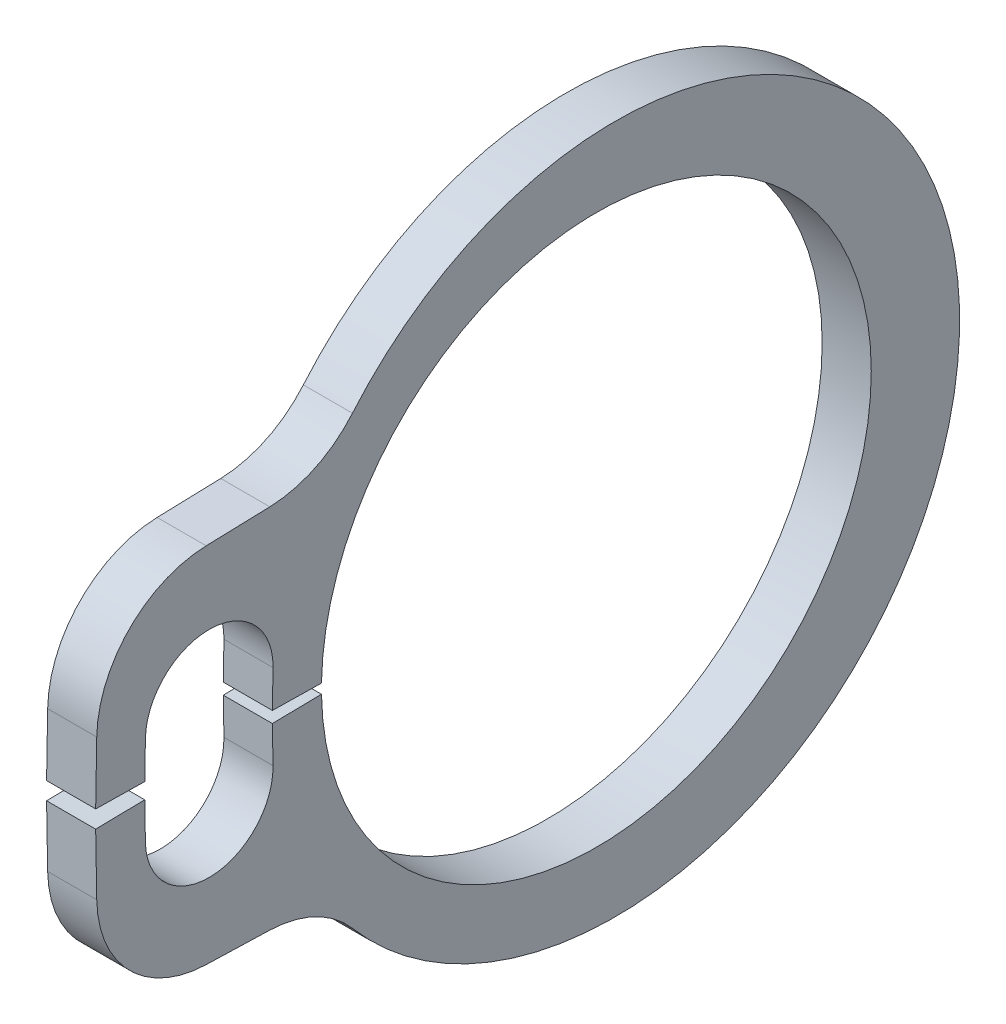
ISO-10303-21;
HEADER;
FILE_DESCRIPTION(('STEP AP214'),'2;1');
FILE_NAME('part.step','',(''),(''),'','','');
FILE_SCHEMA(('AUTOMOTIVE_DESIGN { 1 0 10303 214 1 1 1 1 }'));
ENDSEC;
DATA;
#1=APPLICATION_CONTEXT('core data for automotive mechanical design processes');
#2=APPLICATION_PROTOCOL_DEFINITION('international standard','automotive_design',2000,#1);
#3=PRODUCT_CONTEXT('',#1,'mechanical');
#4=PRODUCT('Part','Part','',(#3));
#5=PRODUCT_RELATED_PRODUCT_CATEGORY('part','',(#4));
#6=PRODUCT_DEFINITION_FORMATION('','',#4);
#7=PRODUCT_DEFINITION_CONTEXT('part definition',#1,'design');
#8=PRODUCT_DEFINITION('design','',#6,#7);
#9=PRODUCT_DEFINITION_SHAPE('','',#8);
#10=(LENGTH_UNIT() NAMED_UNIT(*) SI_UNIT(.MILLI.,.METRE.));
#11=(NAMED_UNIT(*) PLANE_ANGLE_UNIT() SI_UNIT($,.RADIAN.));
#12=(NAMED_UNIT(*) SI_UNIT($,.STERADIAN.) SOLID_ANGLE_UNIT());
#13=UNCERTAINTY_MEASURE_WITH_UNIT(LENGTH_MEASURE(1.E-05),#10,'distance_accuracy_value','');
#14=(GEOMETRIC_REPRESENTATION_CONTEXT(3) GLOBAL_UNCERTAINTY_ASSIGNED_CONTEXT((#13)) GLOBAL_UNIT_ASSIGNED_CONTEXT((#10,
#11,#12)) REPRESENTATION_CONTEXT('',''));
#15=CARTESIAN_POINT('',(0.,0.,0.));
#16=DIRECTION('',(0.,0.,1.));
#17=DIRECTION('',(1.,0.,0.));
#18=AXIS2_PLACEMENT_3D('',#15,#16,#17);
#19=CARTESIAN_POINT('',(0.127,0.,0.));
#20=DIRECTION('',(-1.,0.,0.));
#21=DIRECTION('',(0.,-1.,0.));
#22=AXIS2_PLACEMENT_3D('',#19,#20,#21);
#23=CYLINDRICAL_SURFACE('',#22,1.4224);
#24=CARTESIAN_POINT('',(-0.127,0.,0.));
#25=DIRECTION('',(-1.,0.,0.));
#26=DIRECTION('',(0.,1.,0.));
#27=AXIS2_PLACEMENT_3D('',#24,#25,#26);
#28=CIRCLE('',#27,1.4224);
#29=CARTESIAN_POINT('',(-0.127,0.0248243029163921,1.42218336159045));
#30=VERTEX_POINT('',#29);
#31=CARTESIAN_POINT('',(-0.127,-0.0248243029163921,1.42218336159045));
#32=VERTEX_POINT('',#31);
#33=EDGE_CURVE('E232',#30,#32,#28,.T.);
#34=ORIENTED_EDGE('',*,*,#33,.T.);
#35=DIRECTION('',(-1.,0.,0.));
#36=VECTOR('',#35,1.);
#37=CARTESIAN_POINT('',(0.127,-0.0248243029163921,1.42218336159045));
#38=LINE('',#37,#36);
#39=CARTESIAN_POINT('',(0.127,-0.0248243029163921,1.42218336159045));
#40=VERTEX_POINT('',#39);
#41=EDGE_CURVE('E212',#40,#32,#38,.T.);
#42=ORIENTED_EDGE('',*,*,#41,.F.);
#43=CARTESIAN_POINT('',(0.127,0.,0.));
#44=DIRECTION('',(-1.,0.,0.));
#45=DIRECTION('',(0.,1.,0.));
#46=AXIS2_PLACEMENT_3D('',#43,#44,#45);
#47=CIRCLE('',#46,1.4224);
#48=CARTESIAN_POINT('',(0.127,0.0248243029163921,1.42218336159045));
#49=VERTEX_POINT('',#48);
#50=EDGE_CURVE('E219',#49,#40,#47,.T.);
#51=ORIENTED_EDGE('',*,*,#50,.F.);
#52=DIRECTION('',(-1.,0.,0.));
#53=VECTOR('',#52,1.);
#54=CARTESIAN_POINT('',(0.127,0.0248243029163921,1.42218336159045));
#55=LINE('',#54,#53);
#56=EDGE_CURVE('E339',#49,#30,#55,.T.);
#57=ORIENTED_EDGE('',*,*,#56,.T.);
#58=EDGE_LOOP('',(#34,#42,#51,#57));
#59=FACE_BOUND('',#58,.T.);
#60=ADVANCED_FACE('F17',(#59),#23,.F.);
#61=CARTESIAN_POINT('',(0.127,-0.0292572141514622,1.67614467616018));
#62=DIRECTION('',(0.,-0.999847695156391,-0.0174524064372837));
#63=DIRECTION('',(0.,0.0174524064372837,-0.999847695156391));
#64=AXIS2_PLACEMENT_3D('',#61,#62,#63);
#65=PLANE('',#64);
#66=DIRECTION('',(0.,-0.0174524064372837,0.999847695156391));
#67=VECTOR('',#66,1.);
#68=CARTESIAN_POINT('',(-0.127,-0.0292572141514622,1.67614467616018));
#69=LINE('',#68,#67);
#70=CARTESIAN_POINT('',(-0.127,-0.0292572141514622,1.67614467616018));
#71=VERTEX_POINT('',#70);
#72=EDGE_CURVE('E342',#32,#71,#69,.T.);
#73=ORIENTED_EDGE('',*,*,#72,.T.);
#74=DIRECTION('',(-1.,0.,0.));
#75=VECTOR('',#74,1.);
#76=CARTESIAN_POINT('',(0.127,-0.0292572141514622,1.67614467616018));
#77=LINE('',#76,#75);
#78=CARTESIAN_POINT('',(0.127,-0.0292572141514622,1.67614467616018));
#79=VERTEX_POINT('',#78);
#80=EDGE_CURVE('E215',#79,#71,#77,.T.);
#81=ORIENTED_EDGE('',*,*,#80,.F.);
#82=DIRECTION('',(0.,-0.0174524064372837,0.999847695156391));
#83=VECTOR('',#82,1.);
#84=CARTESIAN_POINT('',(0.127,-0.0292572141514622,1.67614467616018));
#85=LINE('',#84,#83);
#86=EDGE_CURVE('E208',#40,#79,#85,.T.);
#87=ORIENTED_EDGE('',*,*,#86,.F.);
#88=ORIENTED_EDGE('',*,*,#41,.T.);
#89=EDGE_LOOP('',(#73,#81,#87,#88));
#90=FACE_BOUND('',#89,.T.);
#91=ADVANCED_FACE('F210',(#90),#65,.F.);
#92=CARTESIAN_POINT('',(0.127,-0.0292572141514622,1.67614467616018));
#93=DIRECTION('',(0.,0.0174524064372829,-0.999847695156391));
#94=DIRECTION('',(0.,0.999847695156391,0.0174524064372829));
#95=AXIS2_PLACEMENT_3D('',#92,#93,#94);
#96=PLANE('',#95);
#97=DIRECTION('',(0.,-0.999847695156391,-0.0174524064372829));
#98=VECTOR('',#97,1.);
#99=CARTESIAN_POINT('',(-0.127,-0.0292572141514622,1.67614467616018));
#100=LINE('',#99,#98);
#101=CARTESIAN_POINT('',(-0.127,-0.219728200078755,1.67281999273387));
#102=VERTEX_POINT('',#101);
#103=EDGE_CURVE('E345',#71,#102,#100,.T.);
#104=ORIENTED_EDGE('',*,*,#103,.T.);
#105=DIRECTION('',(-1.,0.,0.));
#106=VECTOR('',#105,1.);
#107=CARTESIAN_POINT('',(0.127,-0.219728200078755,1.67281999273387));
#108=LINE('',#107,#106);
#109=CARTESIAN_POINT('',(0.127,-0.219728200078755,1.67281999273387));
#110=VERTEX_POINT('',#109);
#111=EDGE_CURVE('E243',#110,#102,#108,.T.);
#112=ORIENTED_EDGE('',*,*,#111,.F.);
#113=DIRECTION('',(0.,-0.999847695156391,-0.0174524064372829));
#114=VECTOR('',#113,1.);
#115=CARTESIAN_POINT('',(0.127,-0.0292572141514622,1.67614467616018));
#116=LINE('',#115,#114);
#117=EDGE_CURVE('E218',#79,#110,#116,.T.);
#118=ORIENTED_EDGE('',*,*,#117,.F.);
#119=ORIENTED_EDGE('',*,*,#80,.T.);
#120=EDGE_LOOP('',(#104,#112,#118,#119));
#121=FACE_BOUND('',#120,.T.);
#122=ADVANCED_FACE('F481',(#121),#96,.F.);
#123=CARTESIAN_POINT('',(0.127,-0.225490984684346,2.00296970167451));
#124=DIRECTION('',(-1.,0.,0.));
#125=DIRECTION('',(0.,-1.,0.));
#126=AXIS2_PLACEMENT_3D('',#123,#124,#125);
#127=CYLINDRICAL_SURFACE('',#126,0.3302);
#128=CARTESIAN_POINT('',(-0.127,-0.225490984684346,2.00296970167451));
#129=DIRECTION('',(-1.,0.,0.));
#130=DIRECTION('',(0.,-1.,0.));
#131=AXIS2_PLACEMENT_3D('',#128,#129,#130);
#132=CIRCLE('',#131,0.3302);
#133=CARTESIAN_POINT('',(-0.127,-0.231253769289937,2.33311941061516));
#134=VERTEX_POINT('',#133);
#135=EDGE_CURVE('E348',#102,#134,#132,.T.);
#136=ORIENTED_EDGE('',*,*,#135,.T.);
#137=DIRECTION('',(-1.,0.,0.));
#138=VECTOR('',#137,1.);
#139=CARTESIAN_POINT('',(0.127,-0.231253769289937,2.33311941061516));
#140=LINE('',#139,#138);
#141=CARTESIAN_POINT('',(0.127,-0.231253769289937,2.33311941061516));
#142=VERTEX_POINT('',#141);
#143=EDGE_CURVE('E412',#142,#134,#140,.T.);
#144=ORIENTED_EDGE('',*,*,#143,.F.);
#145=CARTESIAN_POINT('',(0.127,-0.225490984684346,2.00296970167451));
#146=DIRECTION('',(-1.,0.,0.));
#147=DIRECTION('',(0.,-1.,0.));
#148=AXIS2_PLACEMENT_3D('',#145,#146,#147);
#149=CIRCLE('',#148,0.3302);
#150=EDGE_CURVE('E425',#110,#142,#149,.T.);
#151=ORIENTED_EDGE('',*,*,#150,.F.);
#152=ORIENTED_EDGE('',*,*,#111,.T.);
#153=EDGE_LOOP('',(#136,#144,#151,#152));
#154=FACE_BOUND('',#153,.T.);
#155=ADVANCED_FACE('F423',(#154),#127,.F.);
#156=CARTESIAN_POINT('',(0.127,-0.0407827833626442,2.33644409404146));
#157=DIRECTION('',(0.,-0.0174524064372829,0.999847695156391));
#158=DIRECTION('',(0.,-0.999847695156391,-0.0174524064372829));
#159=AXIS2_PLACEMENT_3D('',#156,#157,#158);
#160=PLANE('',#159);
#161=DIRECTION('',(0.,0.999847695156391,0.0174524064372829));
#162=VECTOR('',#161,1.);
#163=CARTESIAN_POINT('',(-0.127,-0.0407827833626442,2.33644409404146));
#164=LINE('',#163,#162);
#165=CARTESIAN_POINT('',(-0.127,-0.0407827833626442,2.33644409404146));
#166=VERTEX_POINT('',#165);
#167=EDGE_CURVE('E351',#134,#166,#164,.T.);
#168=ORIENTED_EDGE('',*,*,#167,.T.);
#169=DIRECTION('',(-1.,0.,0.));
#170=VECTOR('',#169,1.);
#171=CARTESIAN_POINT('',(0.127,-0.0407827833626442,2.33644409404146));
#172=LINE('',#171,#170);
#173=CARTESIAN_POINT('',(0.127,-0.0407827833626442,2.33644409404146));
#174=VERTEX_POINT('',#173);
#175=EDGE_CURVE('E408',#174,#166,#172,.T.);
#176=ORIENTED_EDGE('',*,*,#175,.F.);
#177=DIRECTION('',(0.,0.999847695156391,0.0174524064372829));
#178=VECTOR('',#177,1.);
#179=CARTESIAN_POINT('',(0.127,-0.0407827833626442,2.33644409404146));
#180=LINE('',#179,#178);
#181=EDGE_CURVE('E442',#142,#174,#180,.T.);
#182=ORIENTED_EDGE('',*,*,#181,.F.);
#183=ORIENTED_EDGE('',*,*,#143,.T.);
#184=EDGE_LOOP('',(#168,#176,#182,#183));
#185=FACE_BOUND('',#184,.T.);
#186=ADVANCED_FACE('F433',(#185),#160,.F.);
#187=CARTESIAN_POINT('',(0.127,-0.0407827833626442,2.33644409404146));
#188=DIRECTION('',(0.,-0.999847695156391,-0.0174524064372833));
#189=DIRECTION('',(0.,0.0174524064372833,-0.999847695156391));
#190=AXIS2_PLACEMENT_3D('',#187,#188,#189);
#191=PLANE('',#190);
#192=DIRECTION('',(0.,-0.0174524064372833,0.999847695156391));
#193=VECTOR('',#192,1.);
#194=CARTESIAN_POINT('',(-0.127,-0.0407827833626442,2.33644409404146));
#195=LINE('',#194,#193);
#196=CARTESIAN_POINT('',(-0.127,-0.0452156945977142,2.59040540861118));
#197=VERTEX_POINT('',#196);
#198=EDGE_CURVE('E354',#166,#197,#195,.T.);
#199=ORIENTED_EDGE('',*,*,#198,.T.);
#200=DIRECTION('',(-1.,0.,0.));
#201=VECTOR('',#200,1.);
#202=CARTESIAN_POINT('',(0.127,-0.0452156945977142,2.59040540861118));
#203=LINE('',#202,#201);
#204=CARTESIAN_POINT('',(0.127,-0.0452156945977142,2.59040540861118));
#205=VERTEX_POINT('',#204);
#206=EDGE_CURVE('E404',#205,#197,#203,.T.);
#207=ORIENTED_EDGE('',*,*,#206,.F.);
#208=DIRECTION('',(0.,-0.0174524064372833,0.999847695156391));
#209=VECTOR('',#208,1.);
#210=CARTESIAN_POINT('',(0.127,-0.0407827833626442,2.33644409404146));
#211=LINE('',#210,#209);
#212=EDGE_CURVE('E439',#174,#205,#211,.T.);
#213=ORIENTED_EDGE('',*,*,#212,.F.);
#214=ORIENTED_EDGE('',*,*,#175,.T.);
#215=EDGE_LOOP('',(#199,#207,#213,#214));
#216=FACE_BOUND('',#215,.T.);
#217=ADVANCED_FACE('F437',(#216),#191,.F.);
#218=CARTESIAN_POINT('',(0.127,-0.0452156945977142,2.59040540861118));
#219=DIRECTION('',(0.,0.0174524064372835,-0.999847695156391));
#220=DIRECTION('',(0.,0.999847695156391,0.0174524064372835));
#221=AXIS2_PLACEMENT_3D('',#218,#219,#220);
#222=PLANE('',#221);
#223=DIRECTION('',(0.,-0.999847695156391,-0.0174524064372835));
#224=VECTOR('',#223,1.);
#225=CARTESIAN_POINT('',(-0.127,-0.0452156945977142,2.59040540861118));
#226=LINE('',#225,#224);
#227=CARTESIAN_POINT('',(-0.127,-0.364602379655856,2.58483049328628));
#228=VERTEX_POINT('',#227);
#229=EDGE_CURVE('E357',#197,#228,#226,.T.);
#230=ORIENTED_EDGE('',*,*,#229,.T.);
#231=DIRECTION('',(-1.,0.,0.));
#232=VECTOR('',#231,1.);
#233=CARTESIAN_POINT('',(0.127,-0.364602379655856,2.58483049328628));
#234=LINE('',#233,#232);
#235=CARTESIAN_POINT('',(0.127,-0.364602379655856,2.58483049328628));
#236=VERTEX_POINT('',#235);
#237=EDGE_CURVE('E51',#228,#236,#234,.F.);
#238=ORIENTED_EDGE('',*,*,#237,.T.);
#239=DIRECTION('',(0.,-0.999847695156391,-0.0174524064372835));
#240=VECTOR('',#239,1.);
#241=CARTESIAN_POINT('',(0.127,-0.0452156945977142,2.59040540861118));
#242=LINE('',#241,#240);
#243=EDGE_CURVE('E441',#205,#236,#242,.T.);
#244=ORIENTED_EDGE('',*,*,#243,.F.);
#245=ORIENTED_EDGE('',*,*,#206,.T.);
#246=EDGE_LOOP('',(#230,#238,#244,#245));
#247=FACE_BOUND('',#246,.T.);
#248=ADVANCED_FACE('F466',(#247),#222,.F.);
#249=CARTESIAN_POINT('',(0.127,-0.92138222986326,2.57511186485019));
#250=DIRECTION('',(0.,0.999536448867091,-0.0304448252772845));
#251=DIRECTION('',(0.,0.0304448252772845,0.999536448867091));
#252=AXIS2_PLACEMENT_3D('',#249,#250,#251);
#253=PLANE('',#252);
#254=DIRECTION('',(0.,-0.0304448252772845,-0.999536448867091));
#255=VECTOR('',#254,1.);
#256=CARTESIAN_POINT('',(-0.127,-0.92138222986326,2.57511186485019));
#257=LINE('',#256,#255);
#258=CARTESIAN_POINT('',(-0.127,-0.93833587724335,2.0185053367029));
#259=VERTEX_POINT('',#258);
#260=CARTESIAN_POINT('',(-0.127,-0.948361312054998,1.68935949931621));
#261=VERTEX_POINT('',#260);
#262=EDGE_CURVE('E305',#259,#261,#257,.T.);
#263=ORIENTED_EDGE('',*,*,#262,.T.);
#264=DIRECTION('',(1.,0.,0.));
#265=VECTOR('',#264,1.);
#266=CARTESIAN_POINT('',(0.127,-0.948361312054998,1.68935949931621));
#267=LINE('',#266,#265);
#268=CARTESIAN_POINT('',(0.127,-0.948361312054998,1.68935949931621));
#269=VERTEX_POINT('',#268);
#270=EDGE_CURVE('E254',#261,#269,#267,.T.);
#271=ORIENTED_EDGE('',*,*,#270,.T.);
#272=DIRECTION('',(0.,-0.0304448252772845,-0.999536448867091));
#273=VECTOR('',#272,1.);
#274=CARTESIAN_POINT('',(0.127,-0.92138222986326,2.57511186485019));
#275=LINE('',#274,#273);
#276=CARTESIAN_POINT('',(0.127,-0.93833587724335,2.0185053367029));
#277=VERTEX_POINT('',#276);
#278=EDGE_CURVE('E323',#277,#269,#275,.T.);
#279=ORIENTED_EDGE('',*,*,#278,.F.);
#280=DIRECTION('',(-1.,0.,0.));
#281=VECTOR('',#280,1.);
#282=CARTESIAN_POINT('',(0.127,-0.93833587724335,2.0185053367029));
#283=LINE('',#282,#281);
#284=EDGE_CURVE('E250',#277,#259,#283,.T.);
#285=ORIENTED_EDGE('',*,*,#284,.T.);
#286=EDGE_LOOP('',(#263,#271,#279,#285));
#287=FACE_BOUND('',#286,.T.);
#288=ADVANCED_FACE('F463',(#287),#253,.F.);
#289=CARTESIAN_POINT('',(0.127,0.,-0.0968666422557803));
#290=DIRECTION('',(-1.,0.,0.));
#291=DIRECTION('',(0.,-1.,0.));
#292=AXIS2_PLACEMENT_3D('',#289,#290,#291);
#293=CYLINDRICAL_SURFACE('',#292,1.78273335774422);
#294=CARTESIAN_POINT('',(0.127,0.,-0.0968666422557803));
#295=DIRECTION('',(1.,0.,0.));
#296=DIRECTION('',(0.,1.,0.));
#297=AXIS2_PLACEMENT_3D('',#294,#295,#296);
#298=CIRCLE('',#297,1.78273335774422);
#299=CARTESIAN_POINT('',(0.127,-1.1540947652548,1.26188406984171));
#300=VERTEX_POINT('',#299);
#301=CARTESIAN_POINT('',(0.127,1.1540947652548,1.26188406984171));
#302=VERTEX_POINT('',#301);
#303=EDGE_CURVE('E311',#300,#302,#298,.T.);
#304=ORIENTED_EDGE('',*,*,#303,.F.);
#305=DIRECTION('',(-1.,0.,0.));
#306=VECTOR('',#305,1.);
#307=CARTESIAN_POINT('',(0.127,-1.1540947652548,1.26188406984171));
#308=LINE('',#307,#306);
#309=CARTESIAN_POINT('',(-0.127,-1.1540947652548,1.26188406984171));
#310=VERTEX_POINT('',#309);
#311=EDGE_CURVE('E241',#300,#310,#308,.T.);
#312=ORIENTED_EDGE('',*,*,#311,.T.);
#313=CARTESIAN_POINT('',(-0.127,0.,-0.0968666422557803));
#314=DIRECTION('',(1.,0.,0.));
#315=DIRECTION('',(0.,1.,0.));
#316=AXIS2_PLACEMENT_3D('',#313,#314,#315);
#317=CIRCLE('',#316,1.78273335774422);
#318=CARTESIAN_POINT('',(-0.127,1.1540947652548,1.26188406984171));
#319=VERTEX_POINT('',#318);
#320=EDGE_CURVE('E293',#310,#319,#317,.T.);
#321=ORIENTED_EDGE('',*,*,#320,.T.);
#322=DIRECTION('',(-1.,0.,0.));
#323=VECTOR('',#322,1.);
#324=CARTESIAN_POINT('',(0.127,1.1540947652548,1.26188406984171));
#325=LINE('',#324,#323);
#326=EDGE_CURVE('E234',#319,#302,#325,.F.);
#327=ORIENTED_EDGE('',*,*,#326,.T.);
#328=EDGE_LOOP('',(#304,#312,#321,#327));
#329=FACE_BOUND('',#328,.T.);
#330=ADVANCED_FACE('F301',(#329),#293,.T.);
#331=CARTESIAN_POINT('',(0.127,0.92138222986326,2.57511186485019));
#332=DIRECTION('',(0.,-0.999536448867091,-0.0304448252772845));
#333=DIRECTION('',(0.,0.0304448252772845,-0.999536448867091));
#334=AXIS2_PLACEMENT_3D('',#331,#332,#333);
#335=PLANE('',#334);
#336=DIRECTION('',(0.,-0.0304448252772845,0.999536448867091));
#337=VECTOR('',#336,1.);
#338=CARTESIAN_POINT('',(0.127,0.92138222986326,2.57511186485019));
#339=LINE('',#338,#337);
#340=CARTESIAN_POINT('',(0.127,0.948361312054998,1.68935949931621));
#341=VERTEX_POINT('',#340);
#342=CARTESIAN_POINT('',(0.127,0.93833587724335,2.0185053367029));
#343=VERTEX_POINT('',#342);
#344=EDGE_CURVE('E310',#341,#343,#339,.T.);
#345=ORIENTED_EDGE('',*,*,#344,.F.);
#346=DIRECTION('',(1.,0.,0.));
#347=VECTOR('',#346,1.);
#348=CARTESIAN_POINT('',(-0.127,0.948361312054998,1.68935949931621));
#349=LINE('',#348,#347);
#350=CARTESIAN_POINT('',(-0.127,0.948361312054998,1.68935949931621));
#351=VERTEX_POINT('',#350);
#352=EDGE_CURVE('E260',#341,#351,#349,.F.);
#353=ORIENTED_EDGE('',*,*,#352,.T.);
#354=DIRECTION('',(0.,-0.0304448252772845,0.999536448867091));
#355=VECTOR('',#354,1.);
#356=CARTESIAN_POINT('',(-0.127,0.92138222986326,2.57511186485019));
#357=LINE('',#356,#355);
#358=CARTESIAN_POINT('',(-0.127,0.93833587724335,2.0185053367029));
#359=VERTEX_POINT('',#358);
#360=EDGE_CURVE('E295',#351,#359,#357,.T.);
#361=ORIENTED_EDGE('',*,*,#360,.T.);
#362=DIRECTION('',(-1.,0.,0.));
#363=VECTOR('',#362,1.);
#364=CARTESIAN_POINT('',(0.127,0.93833587724335,2.0185053367029));
#365=LINE('',#364,#363);
#366=EDGE_CURVE('E257',#359,#343,#365,.F.);
#367=ORIENTED_EDGE('',*,*,#366,.T.);
#368=EDGE_LOOP('',(#345,#353,#361,#367));
#369=FACE_BOUND('',#368,.T.);
#370=ADVANCED_FACE('F313',(#369),#335,.F.);
#371=CARTESIAN_POINT('',(0.127,0.0452156945977142,2.59040540861118));
#372=DIRECTION('',(0.,-0.0174524064372835,-0.999847695156391));
#373=DIRECTION('',(0.,0.999847695156391,-0.0174524064372835));
#374=AXIS2_PLACEMENT_3D('',#371,#372,#373);
#375=PLANE('',#374);
#376=DIRECTION('',(0.,-0.999847695156391,0.0174524064372835));
#377=VECTOR('',#376,1.);
#378=CARTESIAN_POINT('',(0.127,0.0452156945977142,2.59040540861118));
#379=LINE('',#378,#377);
#380=CARTESIAN_POINT('',(0.127,0.364602379655856,2.58483049328628));
#381=VERTEX_POINT('',#380);
#382=CARTESIAN_POINT('',(0.127,0.0452156945977142,2.59040540861118));
#383=VERTEX_POINT('',#382);
#384=EDGE_CURVE('E316',#381,#383,#379,.T.);
#385=ORIENTED_EDGE('',*,*,#384,.F.);
#386=DIRECTION('',(-1.,0.,0.));
#387=VECTOR('',#386,1.);
#388=CARTESIAN_POINT('',(0.127,0.364602379655856,2.58483049328628));
#389=LINE('',#388,#387);
#390=CARTESIAN_POINT('',(-0.127,0.364602379655856,2.58483049328628));
#391=VERTEX_POINT('',#390);
#392=EDGE_CURVE('E275',#381,#391,#389,.T.);
#393=ORIENTED_EDGE('',*,*,#392,.T.);
#394=DIRECTION('',(0.,-0.999847695156391,0.0174524064372835));
#395=VECTOR('',#394,1.);
#396=CARTESIAN_POINT('',(-0.127,0.0452156945977142,2.59040540861118));
#397=LINE('',#396,#395);
#398=CARTESIAN_POINT('',(-0.127,0.0452156945977142,2.59040540861118));
#399=VERTEX_POINT('',#398);
#400=EDGE_CURVE('E365',#391,#399,#397,.T.);
#401=ORIENTED_EDGE('',*,*,#400,.T.);
#402=DIRECTION('',(-1.,0.,0.));
#403=VECTOR('',#402,1.);
#404=CARTESIAN_POINT('',(0.127,0.0452156945977142,2.59040540861118));
#405=LINE('',#404,#403);
#406=EDGE_CURVE('E400',#383,#399,#405,.T.);
#407=ORIENTED_EDGE('',*,*,#406,.F.);
#408=EDGE_LOOP('',(#385,#393,#401,#407));
#409=FACE_BOUND('',#408,.T.);
#410=ADVANCED_FACE('F498',(#409),#375,.F.);
#411=CARTESIAN_POINT('',(0.127,0.0407827833626442,2.33644409404146));
#412=DIRECTION('',(0.,0.999847695156391,-0.0174524064372833));
#413=DIRECTION('',(0.,0.0174524064372833,0.999847695156391));
#414=AXIS2_PLACEMENT_3D('',#411,#412,#413);
#415=PLANE('',#414);
#416=DIRECTION('',(0.,-0.0174524064372833,-0.999847695156391));
#417=VECTOR('',#416,1.);
#418=CARTESIAN_POINT('',(-0.127,0.0407827833626442,2.33644409404146));
#419=LINE('',#418,#417);
#420=CARTESIAN_POINT('',(-0.127,0.0407827833626442,2.33644409404146));
#421=VERTEX_POINT('',#420);
#422=EDGE_CURVE('E368',#399,#421,#419,.T.);
#423=ORIENTED_EDGE('',*,*,#422,.T.);
#424=DIRECTION('',(-1.,0.,0.));
#425=VECTOR('',#424,1.);
#426=CARTESIAN_POINT('',(0.127,0.0407827833626442,2.33644409404146));
#427=LINE('',#426,#425);
#428=CARTESIAN_POINT('',(0.127,0.0407827833626442,2.33644409404146));
#429=VERTEX_POINT('',#428);
#430=EDGE_CURVE('E396',#429,#421,#427,.T.);
#431=ORIENTED_EDGE('',*,*,#430,.F.);
#432=DIRECTION('',(0.,-0.0174524064372833,-0.999847695156391));
#433=VECTOR('',#432,1.);
#434=CARTESIAN_POINT('',(0.127,0.0407827833626442,2.33644409404146));
#435=LINE('',#434,#433);
#436=EDGE_CURVE('E320',#383,#429,#435,.T.);
#437=ORIENTED_EDGE('',*,*,#436,.F.);
#438=ORIENTED_EDGE('',*,*,#406,.T.);
#439=EDGE_LOOP('',(#423,#431,#437,#438));
#440=FACE_BOUND('',#439,.T.);
#441=ADVANCED_FACE('F505',(#440),#415,.F.);
#442=CARTESIAN_POINT('',(0.127,0.0407827833626442,2.33644409404146));
#443=DIRECTION('',(0.,0.0174524064372829,0.999847695156391));
#444=DIRECTION('',(0.,-0.999847695156391,0.0174524064372829));
#445=AXIS2_PLACEMENT_3D('',#442,#443,#444);
#446=PLANE('',#445);
#447=DIRECTION('',(0.,0.999847695156391,-0.0174524064372829));
#448=VECTOR('',#447,1.);
#449=CARTESIAN_POINT('',(-0.127,0.0407827833626442,2.33644409404146));
#450=LINE('',#449,#448);
#451=CARTESIAN_POINT('',(-0.127,0.231253769289937,2.33311941061516));
#452=VERTEX_POINT('',#451);
#453=EDGE_CURVE('E371',#421,#452,#450,.T.);
#454=ORIENTED_EDGE('',*,*,#453,.T.);
#455=DIRECTION('',(-1.,0.,0.));
#456=VECTOR('',#455,1.);
#457=CARTESIAN_POINT('',(0.127,0.231253769289937,2.33311941061516));
#458=LINE('',#457,#456);
#459=CARTESIAN_POINT('',(0.127,0.231253769289937,2.33311941061516));
#460=VERTEX_POINT('',#459);
#461=EDGE_CURVE('E392',#460,#452,#458,.T.);
#462=ORIENTED_EDGE('',*,*,#461,.F.);
#463=DIRECTION('',(0.,0.999847695156391,-0.0174524064372829));
#464=VECTOR('',#463,1.);
#465=CARTESIAN_POINT('',(0.127,0.0407827833626442,2.33644409404146));
#466=LINE('',#465,#464);
#467=EDGE_CURVE('E329',#429,#460,#466,.T.);
#468=ORIENTED_EDGE('',*,*,#467,.F.);
#469=ORIENTED_EDGE('',*,*,#430,.T.);
#470=EDGE_LOOP('',(#454,#462,#468,#469));
#471=FACE_BOUND('',#470,.T.);
#472=ADVANCED_FACE('F509',(#471),#446,.F.);
#473=CARTESIAN_POINT('',(0.127,0.225490984684346,2.00296970167451));
#474=DIRECTION('',(-1.,0.,0.));
#475=DIRECTION('',(0.,-1.,0.));
#476=AXIS2_PLACEMENT_3D('',#473,#474,#475);
#477=CYLINDRICAL_SURFACE('',#476,0.3302);
#478=CARTESIAN_POINT('',(-0.127,0.225490984684346,2.00296970167451));
#479=DIRECTION('',(-1.,0.,0.));
#480=DIRECTION('',(0.,1.,0.));
#481=AXIS2_PLACEMENT_3D('',#478,#479,#480);
#482=CIRCLE('',#481,0.3302);
#483=CARTESIAN_POINT('',(-0.127,0.219728200078755,1.67281999273387));
#484=VERTEX_POINT('',#483);
#485=EDGE_CURVE('E374',#452,#484,#482,.T.);
#486=ORIENTED_EDGE('',*,*,#485,.T.);
#487=DIRECTION('',(-1.,0.,0.));
#488=VECTOR('',#487,1.);
#489=CARTESIAN_POINT('',(0.127,0.219728200078755,1.67281999273387));
#490=LINE('',#489,#488);
#491=CARTESIAN_POINT('',(0.127,0.219728200078755,1.67281999273387));
#492=VERTEX_POINT('',#491);
#493=EDGE_CURVE('E388',#492,#484,#490,.T.);
#494=ORIENTED_EDGE('',*,*,#493,.F.);
#495=CARTESIAN_POINT('',(0.127,0.225490984684346,2.00296970167451));
#496=DIRECTION('',(-1.,0.,0.));
#497=DIRECTION('',(0.,1.,0.));
#498=AXIS2_PLACEMENT_3D('',#495,#496,#497);
#499=CIRCLE('',#498,0.3302);
#500=EDGE_CURVE('E332',#460,#492,#499,.T.);
#501=ORIENTED_EDGE('',*,*,#500,.F.);
#502=ORIENTED_EDGE('',*,*,#461,.T.);
#503=EDGE_LOOP('',(#486,#494,#501,#502));
#504=FACE_BOUND('',#503,.T.);
#505=ADVANCED_FACE('F516',(#504),#477,.F.);
#506=CARTESIAN_POINT('',(0.127,0.0292572141514622,1.67614467616018));
#507=DIRECTION('',(0.,-0.0174524064372829,-0.999847695156391));
#508=DIRECTION('',(0.,0.999847695156391,-0.0174524064372829));
#509=AXIS2_PLACEMENT_3D('',#506,#507,#508);
#510=PLANE('',#509);
#511=DIRECTION('',(0.,-0.999847695156391,0.0174524064372829));
#512=VECTOR('',#511,1.);
#513=CARTESIAN_POINT('',(-0.127,0.0292572141514622,1.67614467616018));
#514=LINE('',#513,#512);
#515=CARTESIAN_POINT('',(-0.127,0.0292572141514622,1.67614467616018));
#516=VERTEX_POINT('',#515);
#517=EDGE_CURVE('E377',#484,#516,#514,.T.);
#518=ORIENTED_EDGE('',*,*,#517,.T.);
#519=DIRECTION('',(-1.,0.,0.));
#520=VECTOR('',#519,1.);
#521=CARTESIAN_POINT('',(0.127,0.0292572141514622,1.67614467616018));
#522=LINE('',#521,#520);
#523=CARTESIAN_POINT('',(0.127,0.0292572141514622,1.67614467616018));
#524=VERTEX_POINT('',#523);
#525=EDGE_CURVE('E384',#524,#516,#522,.T.);
#526=ORIENTED_EDGE('',*,*,#525,.F.);
#527=DIRECTION('',(0.,-0.999847695156391,0.0174524064372829));
#528=VECTOR('',#527,1.);
#529=CARTESIAN_POINT('',(0.127,0.0292572141514622,1.67614467616018));
#530=LINE('',#529,#528);
#531=EDGE_CURVE('E335',#492,#524,#530,.T.);
#532=ORIENTED_EDGE('',*,*,#531,.F.);
#533=ORIENTED_EDGE('',*,*,#493,.T.);
#534=EDGE_LOOP('',(#518,#526,#532,#533));
#535=FACE_BOUND('',#534,.T.);
#536=ADVANCED_FACE('F519',(#535),#510,.F.);
#537=CARTESIAN_POINT('',(0.127,0.0292572141514622,1.67614467616018));
#538=DIRECTION('',(0.,0.999847695156391,-0.0174524064372837));
#539=DIRECTION('',(0.,0.0174524064372837,0.999847695156391));
#540=AXIS2_PLACEMENT_3D('',#537,#538,#539);
#541=PLANE('',#540);
#542=DIRECTION('',(0.,-0.0174524064372837,-0.999847695156391));
#543=VECTOR('',#542,1.);
#544=CARTESIAN_POINT('',(-0.127,0.0292572141514622,1.67614467616018));
#545=LINE('',#544,#543);
#546=EDGE_CURVE('E229',#516,#30,#545,.T.);
#547=ORIENTED_EDGE('',*,*,#546,.T.);
#548=ORIENTED_EDGE('',*,*,#56,.F.);
#549=DIRECTION('',(0.,-0.0174524064372837,-0.999847695156391));
#550=VECTOR('',#549,1.);
#551=CARTESIAN_POINT('',(0.127,0.0292572141514622,1.67614467616018));
#552=LINE('',#551,#550);
#553=EDGE_CURVE('E224',#524,#49,#552,.T.);
#554=ORIENTED_EDGE('',*,*,#553,.F.);
#555=ORIENTED_EDGE('',*,*,#525,.T.);
#556=EDGE_LOOP('',(#547,#548,#554,#555));
#557=FACE_BOUND('',#556,.T.);
#558=ADVANCED_FACE('F522',(#557),#541,.F.);
#559=CARTESIAN_POINT('',(0.127,0.,0.));
#560=DIRECTION('',(1.,0.,0.));
#561=DIRECTION('',(0.,1.,0.));
#562=AXIS2_PLACEMENT_3D('',#559,#560,#561);
#563=PLANE('',#562);
#564=ORIENTED_EDGE('',*,*,#243,.T.);
#565=CARTESIAN_POINT('',(0.127,-0.354406683815195,2.00071946977592));
#566=DIRECTION('',(1.,0.,0.));
#567=DIRECTION('',(0.,1.,0.));
#568=AXIS2_PLACEMENT_3D('',#565,#566,#567);
#569=CIRCLE('',#568,0.5842);
#570=EDGE_CURVE('E272',#236,#277,#569,.T.);
#571=ORIENTED_EDGE('',*,*,#570,.T.);
#572=ORIENTED_EDGE('',*,*,#278,.T.);
#573=CARTESIAN_POINT('',(0.127,-1.53229050548316,1.7071453662432));
#574=DIRECTION('',(1.,0.,0.));
#575=DIRECTION('',(0.,1.,0.));
#576=AXIS2_PLACEMENT_3D('',#573,#574,#575);
#577=CIRCLE('',#576,0.5842);
#578=EDGE_CURVE('E282',#269,#300,#577,.F.);
#579=ORIENTED_EDGE('',*,*,#578,.T.);
#580=ORIENTED_EDGE('',*,*,#303,.T.);
#581=CARTESIAN_POINT('',(0.127,1.53229050548316,1.7071453662432));
#582=DIRECTION('',(1.,0.,0.));
#583=DIRECTION('',(0.,1.,0.));
#584=AXIS2_PLACEMENT_3D('',#581,#582,#583);
#585=CIRCLE('',#584,0.5842);
#586=EDGE_CURVE('E11',#302,#341,#585,.F.);
#587=ORIENTED_EDGE('',*,*,#586,.T.);
#588=ORIENTED_EDGE('',*,*,#344,.T.);
#589=CARTESIAN_POINT('',(0.127,0.354406683815195,2.00071946977592));
#590=DIRECTION('',(1.,0.,0.));
#591=DIRECTION('',(0.,1.,0.));
#592=AXIS2_PLACEMENT_3D('',#589,#590,#591);
#593=CIRCLE('',#592,0.5842);
#594=EDGE_CURVE('E39',#343,#381,#593,.T.);
#595=ORIENTED_EDGE('',*,*,#594,.T.);
#596=ORIENTED_EDGE('',*,*,#384,.T.);
#597=ORIENTED_EDGE('',*,*,#436,.T.);
#598=ORIENTED_EDGE('',*,*,#467,.T.);
#599=ORIENTED_EDGE('',*,*,#500,.T.);
#600=ORIENTED_EDGE('',*,*,#531,.T.);
#601=ORIENTED_EDGE('',*,*,#553,.T.);
#602=ORIENTED_EDGE('',*,*,#50,.T.);
#603=ORIENTED_EDGE('',*,*,#86,.T.);
#604=ORIENTED_EDGE('',*,*,#117,.T.);
#605=ORIENTED_EDGE('',*,*,#150,.T.);
#606=ORIENTED_EDGE('',*,*,#181,.T.);
#607=ORIENTED_EDGE('',*,*,#212,.T.);
#608=EDGE_LOOP('',(#564,#571,#572,#579,#580,#587,#588,#595,#596,#597,#598,#599,#600,#601,#602,
#603,#604,#605,#606,#607));
#609=FACE_BOUND('',#608,.T.);
#610=ADVANCED_FACE('F222',(#609),#563,.T.);
#611=CARTESIAN_POINT('',(-0.127,0.,0.));
#612=DIRECTION('',(1.,0.,0.));
#613=DIRECTION('',(0.,1.,0.));
#614=AXIS2_PLACEMENT_3D('',#611,#612,#613);
#615=PLANE('',#614);
#616=ORIENTED_EDGE('',*,*,#262,.F.);
#617=CARTESIAN_POINT('',(-0.127,-0.354406683815195,2.00071946977592));
#618=DIRECTION('',(1.,0.,0.));
#619=DIRECTION('',(0.,1.,0.));
#620=AXIS2_PLACEMENT_3D('',#617,#618,#619);
#621=CIRCLE('',#620,0.5842);
#622=EDGE_CURVE('E267',#259,#228,#621,.F.);
#623=ORIENTED_EDGE('',*,*,#622,.T.);
#624=ORIENTED_EDGE('',*,*,#229,.F.);
#625=ORIENTED_EDGE('',*,*,#198,.F.);
#626=ORIENTED_EDGE('',*,*,#167,.F.);
#627=ORIENTED_EDGE('',*,*,#135,.F.);
#628=ORIENTED_EDGE('',*,*,#103,.F.);
#629=ORIENTED_EDGE('',*,*,#72,.F.);
#630=ORIENTED_EDGE('',*,*,#33,.F.);
#631=ORIENTED_EDGE('',*,*,#546,.F.);
#632=ORIENTED_EDGE('',*,*,#517,.F.);
#633=ORIENTED_EDGE('',*,*,#485,.F.);
#634=ORIENTED_EDGE('',*,*,#453,.F.);
#635=ORIENTED_EDGE('',*,*,#422,.F.);
#636=ORIENTED_EDGE('',*,*,#400,.F.);
#637=CARTESIAN_POINT('',(-0.127,0.354406683815195,2.00071946977592));
#638=DIRECTION('',(1.,0.,0.));
#639=DIRECTION('',(0.,1.,0.));
#640=AXIS2_PLACEMENT_3D('',#637,#638,#639);
#641=CIRCLE('',#640,0.5842);
#642=EDGE_CURVE('E264',#391,#359,#641,.F.);
#643=ORIENTED_EDGE('',*,*,#642,.T.);
#644=ORIENTED_EDGE('',*,*,#360,.F.);
#645=CARTESIAN_POINT('',(-0.127,1.53229050548316,1.7071453662432));
#646=DIRECTION('',(1.,0.,0.));
#647=DIRECTION('',(0.,1.,0.));
#648=AXIS2_PLACEMENT_3D('',#645,#646,#647);
#649=CIRCLE('',#648,0.5842);
#650=EDGE_CURVE('E26',#351,#319,#649,.T.);
#651=ORIENTED_EDGE('',*,*,#650,.T.);
#652=ORIENTED_EDGE('',*,*,#320,.F.);
#653=CARTESIAN_POINT('',(-0.127,-1.53229050548316,1.7071453662432));
#654=DIRECTION('',(1.,0.,0.));
#655=DIRECTION('',(0.,1.,0.));
#656=AXIS2_PLACEMENT_3D('',#653,#654,#655);
#657=CIRCLE('',#656,0.5842);
#658=EDGE_CURVE('E279',#310,#261,#657,.T.);
#659=ORIENTED_EDGE('',*,*,#658,.T.);
#660=EDGE_LOOP('',(#616,#623,#624,#625,#626,#627,#628,#629,#630,#631,#632,#633,#634,#635,#636,
#643,#644,#651,#652,#659));
#661=FACE_BOUND('',#660,.T.);
#662=ADVANCED_FACE('F292',(#661),#615,.F.);
#663=CARTESIAN_POINT('',(0.127,-1.53229050548316,1.7071453662432));
#664=DIRECTION('',(-1.,0.,0.));
#665=DIRECTION('',(0.,-1.,0.));
#666=AXIS2_PLACEMENT_3D('',#663,#664,#665);
#667=CYLINDRICAL_SURFACE('',#666,0.5842);
#668=ORIENTED_EDGE('',*,*,#578,.F.);
#669=ORIENTED_EDGE('',*,*,#270,.F.);
#670=ORIENTED_EDGE('',*,*,#658,.F.);
#671=ORIENTED_EDGE('',*,*,#311,.F.);
#672=EDGE_LOOP('',(#668,#669,#670,#671));
#673=FACE_BOUND('',#672,.T.);
#674=ADVANCED_FACE('F462',(#673),#667,.F.);
#675=CARTESIAN_POINT('',(0.127,1.53229050548316,1.7071453662432));
#676=DIRECTION('',(-1.,0.,0.));
#677=DIRECTION('',(0.,-1.,0.));
#678=AXIS2_PLACEMENT_3D('',#675,#676,#677);
#679=CYLINDRICAL_SURFACE('',#678,0.5842);
#680=ORIENTED_EDGE('',*,*,#586,.F.);
#681=ORIENTED_EDGE('',*,*,#326,.F.);
#682=ORIENTED_EDGE('',*,*,#650,.F.);
#683=ORIENTED_EDGE('',*,*,#352,.F.);
#684=EDGE_LOOP('',(#680,#681,#682,#683));
#685=FACE_BOUND('',#684,.T.);
#686=ADVANCED_FACE('F308',(#685),#679,.F.);
#687=CARTESIAN_POINT('',(0.127,-0.354406683815195,2.00071946977592));
#688=DIRECTION('',(-1.,0.,0.));
#689=DIRECTION('',(0.,-1.,0.));
#690=AXIS2_PLACEMENT_3D('',#687,#688,#689);
#691=CYLINDRICAL_SURFACE('',#690,0.5842);
#692=ORIENTED_EDGE('',*,*,#570,.F.);
#693=ORIENTED_EDGE('',*,*,#237,.F.);
#694=ORIENTED_EDGE('',*,*,#622,.F.);
#695=ORIENTED_EDGE('',*,*,#284,.F.);
#696=EDGE_LOOP('',(#692,#693,#694,#695));
#697=FACE_BOUND('',#696,.T.);
#698=ADVANCED_FACE('F465',(#697),#691,.T.);
#699=CARTESIAN_POINT('',(0.127,0.354406683815195,2.00071946977592));
#700=DIRECTION('',(-1.,0.,0.));
#701=DIRECTION('',(0.,-1.,0.));
#702=AXIS2_PLACEMENT_3D('',#699,#700,#701);
#703=CYLINDRICAL_SURFACE('',#702,0.5842);
#704=ORIENTED_EDGE('',*,*,#594,.F.);
#705=ORIENTED_EDGE('',*,*,#366,.F.);
#706=ORIENTED_EDGE('',*,*,#642,.F.);
#707=ORIENTED_EDGE('',*,*,#392,.F.);
#708=EDGE_LOOP('',(#704,#705,#706,#707));
#709=FACE_BOUND('',#708,.T.);
#710=ADVANCED_FACE('F19',(#709),#703,.T.);
#711=CLOSED_SHELL('',(#60,#91,#122,#155,#186,#217,#248,#288,#330,#370,#410,#441,#472,#505,#536,
#558,#610,#662,#674,#686,#698,#710));
#712=MANIFOLD_SOLID_BREP('B1',#711);
#713=ADVANCED_BREP_SHAPE_REPRESENTATION('',(#18,#712),#14);
#714=SHAPE_DEFINITION_REPRESENTATION(#9,#713);
ENDSEC;
END-ISO-10303-21;
